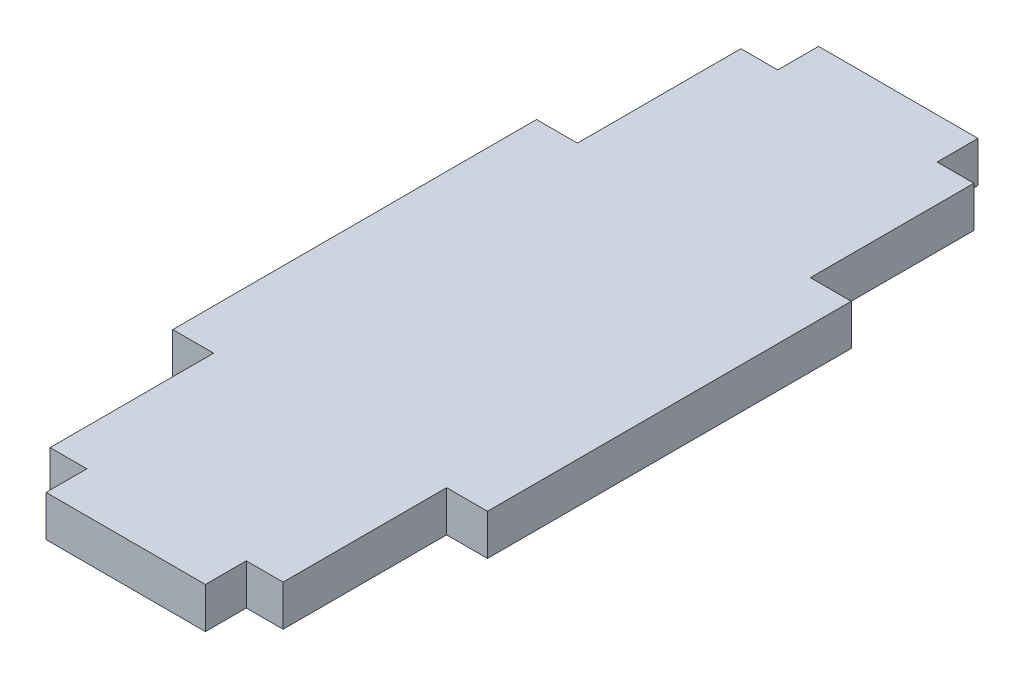
ISO-10303-21;
HEADER;
FILE_DESCRIPTION(('STEP AP214'),'2;1');
FILE_NAME('part.step','',(''),(''),'','','');
FILE_SCHEMA(('AUTOMOTIVE_DESIGN { 1 0 10303 214 1 1 1 1 }'));
ENDSEC;
DATA;
#1=APPLICATION_CONTEXT('core data for automotive mechanical design processes');
#2=APPLICATION_PROTOCOL_DEFINITION('international standard','automotive_design',2000,#1);
#3=PRODUCT_CONTEXT('',#1,'mechanical');
#4=PRODUCT('Part','Part','',(#3));
#5=PRODUCT_RELATED_PRODUCT_CATEGORY('part','',(#4));
#6=PRODUCT_DEFINITION_FORMATION('','',#4);
#7=PRODUCT_DEFINITION_CONTEXT('part definition',#1,'design');
#8=PRODUCT_DEFINITION('design','',#6,#7);
#9=PRODUCT_DEFINITION_SHAPE('','',#8);
#10=(LENGTH_UNIT() NAMED_UNIT(*) SI_UNIT(.MILLI.,.METRE.));
#11=(NAMED_UNIT(*) PLANE_ANGLE_UNIT() SI_UNIT($,.RADIAN.));
#12=(NAMED_UNIT(*) SI_UNIT($,.STERADIAN.) SOLID_ANGLE_UNIT());
#13=UNCERTAINTY_MEASURE_WITH_UNIT(LENGTH_MEASURE(1.E-05),#10,'distance_accuracy_value','');
#14=(GEOMETRIC_REPRESENTATION_CONTEXT(3) GLOBAL_UNCERTAINTY_ASSIGNED_CONTEXT((#13)) GLOBAL_UNIT_ASSIGNED_CONTEXT((#10,
#11,#12)) REPRESENTATION_CONTEXT('',''));
#15=CARTESIAN_POINT('',(0.,0.,0.));
#16=DIRECTION('',(0.,0.,1.));
#17=DIRECTION('',(1.,0.,0.));
#18=AXIS2_PLACEMENT_3D('',#15,#16,#17);
#19=CARTESIAN_POINT('',(-14.25,5.,-42.25));
#20=DIRECTION('',(1.,0.,0.));
#21=DIRECTION('',(0.,0.,-1.));
#22=AXIS2_PLACEMENT_3D('',#19,#20,#21);
#23=PLANE('',#22);
#24=DIRECTION('',(0.,0.,1.));
#25=VECTOR('',#24,1.);
#26=CARTESIAN_POINT('',(-14.25,0.,-42.25));
#27=LINE('',#26,#25);
#28=CARTESIAN_POINT('',(-14.25,0.,-42.25));
#29=VERTEX_POINT('',#28);
#30=CARTESIAN_POINT('',(-14.25,0.,-22.25));
#31=VERTEX_POINT('',#30);
#32=EDGE_CURVE('E201',#29,#31,#27,.T.);
#33=ORIENTED_EDGE('',*,*,#32,.T.);
#34=DIRECTION('',(0.,-1.,0.));
#35=VECTOR('',#34,1.);
#36=CARTESIAN_POINT('',(-14.25,5.,-22.25));
#37=LINE('',#36,#35);
#38=CARTESIAN_POINT('',(-14.25,5.,-22.25));
#39=VERTEX_POINT('',#38);
#40=EDGE_CURVE('E11',#39,#31,#37,.T.);
#41=ORIENTED_EDGE('',*,*,#40,.F.);
#42=DIRECTION('',(0.,0.,1.));
#43=VECTOR('',#42,1.);
#44=CARTESIAN_POINT('',(-14.25,5.,-42.25));
#45=LINE('',#44,#43);
#46=CARTESIAN_POINT('',(-14.25,5.,-42.25));
#47=VERTEX_POINT('',#46);
#48=EDGE_CURVE('E239',#47,#39,#45,.T.);
#49=ORIENTED_EDGE('',*,*,#48,.F.);
#50=DIRECTION('',(0.,-1.,0.));
#51=VECTOR('',#50,1.);
#52=CARTESIAN_POINT('',(-14.25,5.,-42.25));
#53=LINE('',#52,#51);
#54=EDGE_CURVE('E197',#47,#29,#53,.T.);
#55=ORIENTED_EDGE('',*,*,#54,.T.);
#56=EDGE_LOOP('',(#33,#41,#49,#55));
#57=FACE_BOUND('',#56,.T.);
#58=ADVANCED_FACE('F33',(#57),#23,.F.);
#59=CARTESIAN_POINT('',(-14.25,5.,-22.25));
#60=DIRECTION('',(0.,0.,1.));
#61=DIRECTION('',(1.,0.,0.));
#62=AXIS2_PLACEMENT_3D('',#59,#60,#61);
#63=PLANE('',#62);
#64=DIRECTION('',(-1.,0.,0.));
#65=VECTOR('',#64,1.);
#66=CARTESIAN_POINT('',(-14.25,0.,-22.25));
#67=LINE('',#66,#65);
#68=CARTESIAN_POINT('',(-19.25,0.,-22.25));
#69=VERTEX_POINT('',#68);
#70=EDGE_CURVE('E204',#31,#69,#67,.T.);
#71=ORIENTED_EDGE('',*,*,#70,.T.);
#72=DIRECTION('',(0.,-1.,0.));
#73=VECTOR('',#72,1.);
#74=CARTESIAN_POINT('',(-19.25,5.,-22.25));
#75=LINE('',#74,#73);
#76=CARTESIAN_POINT('',(-19.25,5.,-22.25));
#77=VERTEX_POINT('',#76);
#78=EDGE_CURVE('E41',#77,#69,#75,.T.);
#79=ORIENTED_EDGE('',*,*,#78,.F.);
#80=DIRECTION('',(-1.,0.,0.));
#81=VECTOR('',#80,1.);
#82=CARTESIAN_POINT('',(-14.25,5.,-22.25));
#83=LINE('',#82,#81);
#84=EDGE_CURVE('E128',#39,#77,#83,.T.);
#85=ORIENTED_EDGE('',*,*,#84,.F.);
#86=ORIENTED_EDGE('',*,*,#40,.T.);
#87=EDGE_LOOP('',(#71,#79,#85,#86));
#88=FACE_BOUND('',#87,.T.);
#89=ADVANCED_FACE('F357',(#88),#63,.F.);
#90=CARTESIAN_POINT('',(-19.25,5.,-22.25));
#91=DIRECTION('',(1.,0.,0.));
#92=DIRECTION('',(0.,0.,-1.));
#93=AXIS2_PLACEMENT_3D('',#90,#91,#92);
#94=PLANE('',#93);
#95=DIRECTION('',(0.,0.,1.));
#96=VECTOR('',#95,1.);
#97=CARTESIAN_POINT('',(-19.25,0.,-22.25));
#98=LINE('',#97,#96);
#99=CARTESIAN_POINT('',(-19.25,0.,22.25));
#100=VERTEX_POINT('',#99);
#101=EDGE_CURVE('E206',#69,#100,#98,.T.);
#102=ORIENTED_EDGE('',*,*,#101,.T.);
#103=DIRECTION('',(0.,-1.,0.));
#104=VECTOR('',#103,1.);
#105=CARTESIAN_POINT('',(-19.25,5.,22.25));
#106=LINE('',#105,#104);
#107=CARTESIAN_POINT('',(-19.25,5.,22.25));
#108=VERTEX_POINT('',#107);
#109=EDGE_CURVE('E282',#108,#100,#106,.T.);
#110=ORIENTED_EDGE('',*,*,#109,.F.);
#111=DIRECTION('',(0.,0.,1.));
#112=VECTOR('',#111,1.);
#113=CARTESIAN_POINT('',(-19.25,5.,-22.25));
#114=LINE('',#113,#112);
#115=EDGE_CURVE('E290',#77,#108,#114,.T.);
#116=ORIENTED_EDGE('',*,*,#115,.F.);
#117=ORIENTED_EDGE('',*,*,#78,.T.);
#118=EDGE_LOOP('',(#102,#110,#116,#117));
#119=FACE_BOUND('',#118,.T.);
#120=ADVANCED_FACE('F288',(#119),#94,.F.);
#121=CARTESIAN_POINT('',(-19.25,5.,22.25));
#122=DIRECTION('',(0.,0.,-1.));
#123=DIRECTION('',(-1.,0.,0.));
#124=AXIS2_PLACEMENT_3D('',#121,#122,#123);
#125=PLANE('',#124);
#126=DIRECTION('',(1.,0.,0.));
#127=VECTOR('',#126,1.);
#128=CARTESIAN_POINT('',(-19.25,0.,22.25));
#129=LINE('',#128,#127);
#130=CARTESIAN_POINT('',(-14.25,0.,22.25));
#131=VERTEX_POINT('',#130);
#132=EDGE_CURVE('E208',#100,#131,#129,.T.);
#133=ORIENTED_EDGE('',*,*,#132,.T.);
#134=DIRECTION('',(0.,-1.,0.));
#135=VECTOR('',#134,1.);
#136=CARTESIAN_POINT('',(-14.25,5.,22.25));
#137=LINE('',#136,#135);
#138=CARTESIAN_POINT('',(-14.25,5.,22.25));
#139=VERTEX_POINT('',#138);
#140=EDGE_CURVE('E279',#139,#131,#137,.T.);
#141=ORIENTED_EDGE('',*,*,#140,.F.);
#142=DIRECTION('',(1.,0.,0.));
#143=VECTOR('',#142,1.);
#144=CARTESIAN_POINT('',(-19.25,5.,22.25));
#145=LINE('',#144,#143);
#146=EDGE_CURVE('E308',#108,#139,#145,.T.);
#147=ORIENTED_EDGE('',*,*,#146,.F.);
#148=ORIENTED_EDGE('',*,*,#109,.T.);
#149=EDGE_LOOP('',(#133,#141,#147,#148));
#150=FACE_BOUND('',#149,.T.);
#151=ADVANCED_FACE('F299',(#150),#125,.F.);
#152=CARTESIAN_POINT('',(-14.25,5.,22.25));
#153=DIRECTION('',(1.,0.,0.));
#154=DIRECTION('',(0.,0.,-1.));
#155=AXIS2_PLACEMENT_3D('',#152,#153,#154);
#156=PLANE('',#155);
#157=DIRECTION('',(0.,0.,1.));
#158=VECTOR('',#157,1.);
#159=CARTESIAN_POINT('',(-14.25,0.,22.25));
#160=LINE('',#159,#158);
#161=CARTESIAN_POINT('',(-14.25,0.,42.25));
#162=VERTEX_POINT('',#161);
#163=EDGE_CURVE('E210',#131,#162,#160,.T.);
#164=ORIENTED_EDGE('',*,*,#163,.T.);
#165=DIRECTION('',(0.,-1.,0.));
#166=VECTOR('',#165,1.);
#167=CARTESIAN_POINT('',(-14.25,5.,42.25));
#168=LINE('',#167,#166);
#169=CARTESIAN_POINT('',(-14.25,5.,42.25));
#170=VERTEX_POINT('',#169);
#171=EDGE_CURVE('E276',#170,#162,#168,.T.);
#172=ORIENTED_EDGE('',*,*,#171,.F.);
#173=DIRECTION('',(0.,0.,1.));
#174=VECTOR('',#173,1.);
#175=CARTESIAN_POINT('',(-14.25,5.,22.25));
#176=LINE('',#175,#174);
#177=EDGE_CURVE('E305',#139,#170,#176,.T.);
#178=ORIENTED_EDGE('',*,*,#177,.F.);
#179=ORIENTED_EDGE('',*,*,#140,.T.);
#180=EDGE_LOOP('',(#164,#172,#178,#179));
#181=FACE_BOUND('',#180,.T.);
#182=ADVANCED_FACE('F303',(#181),#156,.F.);
#183=CARTESIAN_POINT('',(-14.25,5.,42.25));
#184=DIRECTION('',(0.,0.,-1.));
#185=DIRECTION('',(-1.,0.,0.));
#186=AXIS2_PLACEMENT_3D('',#183,#184,#185);
#187=PLANE('',#186);
#188=DIRECTION('',(1.,0.,0.));
#189=VECTOR('',#188,1.);
#190=CARTESIAN_POINT('',(-14.25,0.,42.25));
#191=LINE('',#190,#189);
#192=CARTESIAN_POINT('',(-9.75,0.,42.25));
#193=VERTEX_POINT('',#192);
#194=EDGE_CURVE('E212',#162,#193,#191,.T.);
#195=ORIENTED_EDGE('',*,*,#194,.T.);
#196=DIRECTION('',(0.,-1.,0.));
#197=VECTOR('',#196,1.);
#198=CARTESIAN_POINT('',(-9.75,5.,42.25));
#199=LINE('',#198,#197);
#200=CARTESIAN_POINT('',(-9.75,5.,42.25));
#201=VERTEX_POINT('',#200);
#202=EDGE_CURVE('E273',#201,#193,#199,.T.);
#203=ORIENTED_EDGE('',*,*,#202,.F.);
#204=DIRECTION('',(1.,0.,0.));
#205=VECTOR('',#204,1.);
#206=CARTESIAN_POINT('',(-14.25,5.,42.25));
#207=LINE('',#206,#205);
#208=EDGE_CURVE('E307',#170,#201,#207,.T.);
#209=ORIENTED_EDGE('',*,*,#208,.F.);
#210=ORIENTED_EDGE('',*,*,#171,.T.);
#211=EDGE_LOOP('',(#195,#203,#209,#210));
#212=FACE_BOUND('',#211,.T.);
#213=ADVANCED_FACE('F370',(#212),#187,.F.);
#214=CARTESIAN_POINT('',(-9.75,5.,42.25));
#215=DIRECTION('',(1.,0.,0.));
#216=DIRECTION('',(0.,0.,-1.));
#217=AXIS2_PLACEMENT_3D('',#214,#215,#216);
#218=PLANE('',#217);
#219=DIRECTION('',(0.,0.,1.));
#220=VECTOR('',#219,1.);
#221=CARTESIAN_POINT('',(-9.75,0.,42.25));
#222=LINE('',#221,#220);
#223=CARTESIAN_POINT('',(-9.74999999999997,0.,47.25));
#224=VERTEX_POINT('',#223);
#225=EDGE_CURVE('E214',#193,#224,#222,.T.);
#226=ORIENTED_EDGE('',*,*,#225,.T.);
#227=DIRECTION('',(0.,-1.,0.));
#228=VECTOR('',#227,1.);
#229=CARTESIAN_POINT('',(-9.74999999999997,5.,47.25));
#230=LINE('',#229,#228);
#231=CARTESIAN_POINT('',(-9.74999999999997,5.,47.25));
#232=VERTEX_POINT('',#231);
#233=EDGE_CURVE('E270',#232,#224,#230,.T.);
#234=ORIENTED_EDGE('',*,*,#233,.F.);
#235=DIRECTION('',(0.,0.,1.));
#236=VECTOR('',#235,1.);
#237=CARTESIAN_POINT('',(-9.75,5.,42.25));
#238=LINE('',#237,#236);
#239=EDGE_CURVE('E310',#201,#232,#238,.T.);
#240=ORIENTED_EDGE('',*,*,#239,.F.);
#241=ORIENTED_EDGE('',*,*,#202,.T.);
#242=EDGE_LOOP('',(#226,#234,#240,#241));
#243=FACE_BOUND('',#242,.T.);
#244=ADVANCED_FACE('F373',(#243),#218,.F.);
#245=CARTESIAN_POINT('',(-9.74999999999997,5.,47.25));
#246=DIRECTION('',(0.,0.,-1.));
#247=DIRECTION('',(-1.,0.,0.));
#248=AXIS2_PLACEMENT_3D('',#245,#246,#247);
#249=PLANE('',#248);
#250=DIRECTION('',(1.,0.,0.));
#251=VECTOR('',#250,1.);
#252=CARTESIAN_POINT('',(-9.74999999999997,0.,47.25));
#253=LINE('',#252,#251);
#254=CARTESIAN_POINT('',(9.75000000000001,0.,47.25));
#255=VERTEX_POINT('',#254);
#256=EDGE_CURVE('E216',#224,#255,#253,.T.);
#257=ORIENTED_EDGE('',*,*,#256,.T.);
#258=DIRECTION('',(0.,-1.,0.));
#259=VECTOR('',#258,1.);
#260=CARTESIAN_POINT('',(9.75000000000001,5.,47.25));
#261=LINE('',#260,#259);
#262=CARTESIAN_POINT('',(9.75000000000001,5.,47.25));
#263=VERTEX_POINT('',#262);
#264=EDGE_CURVE('E267',#263,#255,#261,.T.);
#265=ORIENTED_EDGE('',*,*,#264,.F.);
#266=DIRECTION('',(1.,0.,0.));
#267=VECTOR('',#266,1.);
#268=CARTESIAN_POINT('',(-9.74999999999997,5.,47.25));
#269=LINE('',#268,#267);
#270=EDGE_CURVE('E316',#232,#263,#269,.T.);
#271=ORIENTED_EDGE('',*,*,#270,.F.);
#272=ORIENTED_EDGE('',*,*,#233,.T.);
#273=EDGE_LOOP('',(#257,#265,#271,#272));
#274=FACE_BOUND('',#273,.T.);
#275=ADVANCED_FACE('F377',(#274),#249,.F.);
#276=CARTESIAN_POINT('',(9.75000000000001,5.,47.25));
#277=DIRECTION('',(-1.,0.,0.));
#278=DIRECTION('',(0.,0.,1.));
#279=AXIS2_PLACEMENT_3D('',#276,#277,#278);
#280=PLANE('',#279);
#281=DIRECTION('',(0.,0.,-1.));
#282=VECTOR('',#281,1.);
#283=CARTESIAN_POINT('',(9.75000000000001,0.,47.25));
#284=LINE('',#283,#282);
#285=CARTESIAN_POINT('',(9.75000000000002,0.,42.25));
#286=VERTEX_POINT('',#285);
#287=EDGE_CURVE('E218',#255,#286,#284,.T.);
#288=ORIENTED_EDGE('',*,*,#287,.T.);
#289=DIRECTION('',(0.,-1.,0.));
#290=VECTOR('',#289,1.);
#291=CARTESIAN_POINT('',(9.75000000000002,5.,42.25));
#292=LINE('',#291,#290);
#293=CARTESIAN_POINT('',(9.75000000000002,5.,42.25));
#294=VERTEX_POINT('',#293);
#295=EDGE_CURVE('E264',#294,#286,#292,.T.);
#296=ORIENTED_EDGE('',*,*,#295,.F.);
#297=DIRECTION('',(0.,0.,-1.));
#298=VECTOR('',#297,1.);
#299=CARTESIAN_POINT('',(9.75000000000001,5.,47.25));
#300=LINE('',#299,#298);
#301=EDGE_CURVE('E318',#263,#294,#300,.T.);
#302=ORIENTED_EDGE('',*,*,#301,.F.);
#303=ORIENTED_EDGE('',*,*,#264,.T.);
#304=EDGE_LOOP('',(#288,#296,#302,#303));
#305=FACE_BOUND('',#304,.T.);
#306=ADVANCED_FACE('F381',(#305),#280,.F.);
#307=CARTESIAN_POINT('',(9.75000000000002,5.,42.25));
#308=DIRECTION('',(0.,0.,-1.));
#309=DIRECTION('',(-1.,0.,0.));
#310=AXIS2_PLACEMENT_3D('',#307,#308,#309);
#311=PLANE('',#310);
#312=DIRECTION('',(1.,0.,0.));
#313=VECTOR('',#312,1.);
#314=CARTESIAN_POINT('',(9.75000000000002,0.,42.25));
#315=LINE('',#314,#313);
#316=CARTESIAN_POINT('',(14.25,0.,42.25));
#317=VERTEX_POINT('',#316);
#318=EDGE_CURVE('E220',#286,#317,#315,.T.);
#319=ORIENTED_EDGE('',*,*,#318,.T.);
#320=DIRECTION('',(0.,-1.,0.));
#321=VECTOR('',#320,1.);
#322=CARTESIAN_POINT('',(14.25,5.,42.25));
#323=LINE('',#322,#321);
#324=CARTESIAN_POINT('',(14.25,5.,42.25));
#325=VERTEX_POINT('',#324);
#326=EDGE_CURVE('E261',#325,#317,#323,.T.);
#327=ORIENTED_EDGE('',*,*,#326,.F.);
#328=DIRECTION('',(1.,0.,0.));
#329=VECTOR('',#328,1.);
#330=CARTESIAN_POINT('',(9.75000000000002,5.,42.25));
#331=LINE('',#330,#329);
#332=EDGE_CURVE('E320',#294,#325,#331,.T.);
#333=ORIENTED_EDGE('',*,*,#332,.F.);
#334=ORIENTED_EDGE('',*,*,#295,.T.);
#335=EDGE_LOOP('',(#319,#327,#333,#334));
#336=FACE_BOUND('',#335,.T.);
#337=ADVANCED_FACE('F385',(#336),#311,.F.);
#338=CARTESIAN_POINT('',(14.25,5.,22.25));
#339=DIRECTION('',(-1.,0.,0.));
#340=DIRECTION('',(0.,0.,1.));
#341=AXIS2_PLACEMENT_3D('',#338,#339,#340);
#342=PLANE('',#341);
#343=DIRECTION('',(0.,0.,-1.));
#344=VECTOR('',#343,1.);
#345=CARTESIAN_POINT('',(14.25,0.,22.25));
#346=LINE('',#345,#344);
#347=CARTESIAN_POINT('',(14.25,0.,22.25));
#348=VERTEX_POINT('',#347);
#349=EDGE_CURVE('E222',#317,#348,#346,.T.);
#350=ORIENTED_EDGE('',*,*,#349,.T.);
#351=DIRECTION('',(0.,-1.,0.));
#352=VECTOR('',#351,1.);
#353=CARTESIAN_POINT('',(14.25,5.,22.25));
#354=LINE('',#353,#352);
#355=CARTESIAN_POINT('',(14.25,5.,22.25));
#356=VERTEX_POINT('',#355);
#357=EDGE_CURVE('E258',#356,#348,#354,.T.);
#358=ORIENTED_EDGE('',*,*,#357,.F.);
#359=DIRECTION('',(0.,0.,-1.));
#360=VECTOR('',#359,1.);
#361=CARTESIAN_POINT('',(14.25,5.,22.25));
#362=LINE('',#361,#360);
#363=EDGE_CURVE('E322',#325,#356,#362,.T.);
#364=ORIENTED_EDGE('',*,*,#363,.F.);
#365=ORIENTED_EDGE('',*,*,#326,.T.);
#366=EDGE_LOOP('',(#350,#358,#364,#365));
#367=FACE_BOUND('',#366,.T.);
#368=ADVANCED_FACE('F389',(#367),#342,.F.);
#369=CARTESIAN_POINT('',(19.25,5.,22.25));
#370=DIRECTION('',(0.,0.,-1.));
#371=DIRECTION('',(-1.,0.,0.));
#372=AXIS2_PLACEMENT_3D('',#369,#370,#371);
#373=PLANE('',#372);
#374=DIRECTION('',(1.,0.,0.));
#375=VECTOR('',#374,1.);
#376=CARTESIAN_POINT('',(19.25,0.,22.25));
#377=LINE('',#376,#375);
#378=CARTESIAN_POINT('',(19.25,0.,22.25));
#379=VERTEX_POINT('',#378);
#380=EDGE_CURVE('E224',#348,#379,#377,.T.);
#381=ORIENTED_EDGE('',*,*,#380,.T.);
#382=DIRECTION('',(0.,-1.,0.));
#383=VECTOR('',#382,1.);
#384=CARTESIAN_POINT('',(19.25,5.,22.25));
#385=LINE('',#384,#383);
#386=CARTESIAN_POINT('',(19.25,5.,22.25));
#387=VERTEX_POINT('',#386);
#388=EDGE_CURVE('E255',#387,#379,#385,.T.);
#389=ORIENTED_EDGE('',*,*,#388,.F.);
#390=DIRECTION('',(1.,0.,0.));
#391=VECTOR('',#390,1.);
#392=CARTESIAN_POINT('',(19.25,5.,22.25));
#393=LINE('',#392,#391);
#394=EDGE_CURVE('E324',#356,#387,#393,.T.);
#395=ORIENTED_EDGE('',*,*,#394,.F.);
#396=ORIENTED_EDGE('',*,*,#357,.T.);
#397=EDGE_LOOP('',(#381,#389,#395,#396));
#398=FACE_BOUND('',#397,.T.);
#399=ADVANCED_FACE('F393',(#398),#373,.F.);
#400=CARTESIAN_POINT('',(19.25,5.,-22.25));
#401=DIRECTION('',(-1.,0.,0.));
#402=DIRECTION('',(0.,0.,1.));
#403=AXIS2_PLACEMENT_3D('',#400,#401,#402);
#404=PLANE('',#403);
#405=DIRECTION('',(0.,0.,-1.));
#406=VECTOR('',#405,1.);
#407=CARTESIAN_POINT('',(19.25,0.,-22.25));
#408=LINE('',#407,#406);
#409=CARTESIAN_POINT('',(19.25,0.,-22.25));
#410=VERTEX_POINT('',#409);
#411=EDGE_CURVE('E226',#379,#410,#408,.T.);
#412=ORIENTED_EDGE('',*,*,#411,.T.);
#413=DIRECTION('',(0.,-1.,0.));
#414=VECTOR('',#413,1.);
#415=CARTESIAN_POINT('',(19.25,5.,-22.25));
#416=LINE('',#415,#414);
#417=CARTESIAN_POINT('',(19.25,5.,-22.25));
#418=VERTEX_POINT('',#417);
#419=EDGE_CURVE('E252',#418,#410,#416,.T.);
#420=ORIENTED_EDGE('',*,*,#419,.F.);
#421=DIRECTION('',(0.,0.,-1.));
#422=VECTOR('',#421,1.);
#423=CARTESIAN_POINT('',(19.25,5.,-22.25));
#424=LINE('',#423,#422);
#425=EDGE_CURVE('E326',#387,#418,#424,.T.);
#426=ORIENTED_EDGE('',*,*,#425,.F.);
#427=ORIENTED_EDGE('',*,*,#388,.T.);
#428=EDGE_LOOP('',(#412,#420,#426,#427));
#429=FACE_BOUND('',#428,.T.);
#430=ADVANCED_FACE('F397',(#429),#404,.F.);
#431=CARTESIAN_POINT('',(14.25,5.,-22.25));
#432=DIRECTION('',(0.,0.,1.));
#433=DIRECTION('',(1.,0.,0.));
#434=AXIS2_PLACEMENT_3D('',#431,#432,#433);
#435=PLANE('',#434);
#436=DIRECTION('',(-1.,0.,0.));
#437=VECTOR('',#436,1.);
#438=CARTESIAN_POINT('',(14.25,0.,-22.25));
#439=LINE('',#438,#437);
#440=CARTESIAN_POINT('',(14.25,0.,-22.25));
#441=VERTEX_POINT('',#440);
#442=EDGE_CURVE('E228',#410,#441,#439,.T.);
#443=ORIENTED_EDGE('',*,*,#442,.T.);
#444=DIRECTION('',(0.,-1.,0.));
#445=VECTOR('',#444,1.);
#446=CARTESIAN_POINT('',(14.25,5.,-22.25));
#447=LINE('',#446,#445);
#448=CARTESIAN_POINT('',(14.25,5.,-22.25));
#449=VERTEX_POINT('',#448);
#450=EDGE_CURVE('E249',#449,#441,#447,.T.);
#451=ORIENTED_EDGE('',*,*,#450,.F.);
#452=DIRECTION('',(-1.,0.,0.));
#453=VECTOR('',#452,1.);
#454=CARTESIAN_POINT('',(14.25,5.,-22.25));
#455=LINE('',#454,#453);
#456=EDGE_CURVE('E328',#418,#449,#455,.T.);
#457=ORIENTED_EDGE('',*,*,#456,.F.);
#458=ORIENTED_EDGE('',*,*,#419,.T.);
#459=EDGE_LOOP('',(#443,#451,#457,#458));
#460=FACE_BOUND('',#459,.T.);
#461=ADVANCED_FACE('F401',(#460),#435,.F.);
#462=CARTESIAN_POINT('',(14.25,5.,-42.25));
#463=DIRECTION('',(-1.,0.,0.));
#464=DIRECTION('',(0.,0.,1.));
#465=AXIS2_PLACEMENT_3D('',#462,#463,#464);
#466=PLANE('',#465);
#467=DIRECTION('',(0.,0.,-1.));
#468=VECTOR('',#467,1.);
#469=CARTESIAN_POINT('',(14.25,0.,-42.25));
#470=LINE('',#469,#468);
#471=CARTESIAN_POINT('',(14.25,0.,-42.25));
#472=VERTEX_POINT('',#471);
#473=EDGE_CURVE('E230',#441,#472,#470,.T.);
#474=ORIENTED_EDGE('',*,*,#473,.T.);
#475=DIRECTION('',(0.,-1.,0.));
#476=VECTOR('',#475,1.);
#477=CARTESIAN_POINT('',(14.25,5.,-42.25));
#478=LINE('',#477,#476);
#479=CARTESIAN_POINT('',(14.25,5.,-42.25));
#480=VERTEX_POINT('',#479);
#481=EDGE_CURVE('E246',#480,#472,#478,.T.);
#482=ORIENTED_EDGE('',*,*,#481,.F.);
#483=DIRECTION('',(0.,0.,-1.));
#484=VECTOR('',#483,1.);
#485=CARTESIAN_POINT('',(14.25,5.,-42.25));
#486=LINE('',#485,#484);
#487=EDGE_CURVE('E330',#449,#480,#486,.T.);
#488=ORIENTED_EDGE('',*,*,#487,.F.);
#489=ORIENTED_EDGE('',*,*,#450,.T.);
#490=EDGE_LOOP('',(#474,#482,#488,#489));
#491=FACE_BOUND('',#490,.T.);
#492=ADVANCED_FACE('F405',(#491),#466,.F.);
#493=CARTESIAN_POINT('',(9.75,5.,-42.25));
#494=DIRECTION('',(0.,0.,1.));
#495=DIRECTION('',(1.,0.,0.));
#496=AXIS2_PLACEMENT_3D('',#493,#494,#495);
#497=PLANE('',#496);
#498=DIRECTION('',(-1.,0.,0.));
#499=VECTOR('',#498,1.);
#500=CARTESIAN_POINT('',(9.75,0.,-42.25));
#501=LINE('',#500,#499);
#502=CARTESIAN_POINT('',(9.75,0.,-42.25));
#503=VERTEX_POINT('',#502);
#504=EDGE_CURVE('E232',#472,#503,#501,.T.);
#505=ORIENTED_EDGE('',*,*,#504,.T.);
#506=DIRECTION('',(0.,-1.,0.));
#507=VECTOR('',#506,1.);
#508=CARTESIAN_POINT('',(9.75,5.,-42.25));
#509=LINE('',#508,#507);
#510=CARTESIAN_POINT('',(9.75,5.,-42.25));
#511=VERTEX_POINT('',#510);
#512=EDGE_CURVE('E243',#511,#503,#509,.T.);
#513=ORIENTED_EDGE('',*,*,#512,.F.);
#514=DIRECTION('',(-1.,0.,0.));
#515=VECTOR('',#514,1.);
#516=CARTESIAN_POINT('',(9.75,5.,-42.25));
#517=LINE('',#516,#515);
#518=EDGE_CURVE('E332',#480,#511,#517,.T.);
#519=ORIENTED_EDGE('',*,*,#518,.F.);
#520=ORIENTED_EDGE('',*,*,#481,.T.);
#521=EDGE_LOOP('',(#505,#513,#519,#520));
#522=FACE_BOUND('',#521,.T.);
#523=ADVANCED_FACE('F338',(#522),#497,.F.);
#524=CARTESIAN_POINT('',(9.75000000000001,5.,-47.25));
#525=DIRECTION('',(-1.,0.,0.));
#526=DIRECTION('',(0.,0.,1.));
#527=AXIS2_PLACEMENT_3D('',#524,#525,#526);
#528=PLANE('',#527);
#529=DIRECTION('',(0.,0.,-1.));
#530=VECTOR('',#529,1.);
#531=CARTESIAN_POINT('',(9.75000000000001,0.,-47.25));
#532=LINE('',#531,#530);
#533=CARTESIAN_POINT('',(9.75000000000001,0.,-47.25));
#534=VERTEX_POINT('',#533);
#535=EDGE_CURVE('E234',#503,#534,#532,.T.);
#536=ORIENTED_EDGE('',*,*,#535,.T.);
#537=DIRECTION('',(0.,-1.,0.));
#538=VECTOR('',#537,1.);
#539=CARTESIAN_POINT('',(9.75000000000001,5.,-47.25));
#540=LINE('',#539,#538);
#541=CARTESIAN_POINT('',(9.75000000000001,5.,-47.25));
#542=VERTEX_POINT('',#541);
#543=EDGE_CURVE('E192',#542,#534,#540,.T.);
#544=ORIENTED_EDGE('',*,*,#543,.F.);
#545=DIRECTION('',(0.,0.,-1.));
#546=VECTOR('',#545,1.);
#547=CARTESIAN_POINT('',(9.75000000000001,5.,-47.25));
#548=LINE('',#547,#546);
#549=EDGE_CURVE('E183',#511,#542,#548,.T.);
#550=ORIENTED_EDGE('',*,*,#549,.F.);
#551=ORIENTED_EDGE('',*,*,#512,.T.);
#552=EDGE_LOOP('',(#536,#544,#550,#551));
#553=FACE_BOUND('',#552,.T.);
#554=ADVANCED_FACE('F342',(#553),#528,.F.);
#555=CARTESIAN_POINT('',(-9.75,5.,-47.25));
#556=DIRECTION('',(0.,0.,1.));
#557=DIRECTION('',(1.,0.,0.));
#558=AXIS2_PLACEMENT_3D('',#555,#556,#557);
#559=PLANE('',#558);
#560=DIRECTION('',(-1.,0.,0.));
#561=VECTOR('',#560,1.);
#562=CARTESIAN_POINT('',(-9.75,0.,-47.25));
#563=LINE('',#562,#561);
#564=CARTESIAN_POINT('',(-9.75,0.,-47.25));
#565=VERTEX_POINT('',#564);
#566=EDGE_CURVE('E191',#534,#565,#563,.T.);
#567=ORIENTED_EDGE('',*,*,#566,.T.);
#568=DIRECTION('',(0.,-1.,0.));
#569=VECTOR('',#568,1.);
#570=CARTESIAN_POINT('',(-9.75,5.,-47.25));
#571=LINE('',#570,#569);
#572=CARTESIAN_POINT('',(-9.75,5.,-47.25));
#573=VERTEX_POINT('',#572);
#574=EDGE_CURVE('E188',#573,#565,#571,.T.);
#575=ORIENTED_EDGE('',*,*,#574,.F.);
#576=DIRECTION('',(-1.,0.,0.));
#577=VECTOR('',#576,1.);
#578=CARTESIAN_POINT('',(-9.75,5.,-47.25));
#579=LINE('',#578,#577);
#580=EDGE_CURVE('E177',#542,#573,#579,.T.);
#581=ORIENTED_EDGE('',*,*,#580,.F.);
#582=ORIENTED_EDGE('',*,*,#543,.T.);
#583=EDGE_LOOP('',(#567,#575,#581,#582));
#584=FACE_BOUND('',#583,.T.);
#585=ADVANCED_FACE('F189',(#584),#559,.F.);
#586=CARTESIAN_POINT('',(-9.75,5.,-42.25));
#587=DIRECTION('',(1.,0.,0.));
#588=DIRECTION('',(0.,0.,-1.));
#589=AXIS2_PLACEMENT_3D('',#586,#587,#588);
#590=PLANE('',#589);
#591=DIRECTION('',(0.,0.,1.));
#592=VECTOR('',#591,1.);
#593=CARTESIAN_POINT('',(-9.75,0.,-42.25));
#594=LINE('',#593,#592);
#595=CARTESIAN_POINT('',(-9.75,0.,-42.25));
#596=VERTEX_POINT('',#595);
#597=EDGE_CURVE('E114',#565,#596,#594,.T.);
#598=ORIENTED_EDGE('',*,*,#597,.T.);
#599=DIRECTION('',(0.,-1.,0.));
#600=VECTOR('',#599,1.);
#601=CARTESIAN_POINT('',(-9.75,5.,-42.25));
#602=LINE('',#601,#600);
#603=CARTESIAN_POINT('',(-9.75,5.,-42.25));
#604=VERTEX_POINT('',#603);
#605=EDGE_CURVE('E193',#604,#596,#602,.T.);
#606=ORIENTED_EDGE('',*,*,#605,.F.);
#607=DIRECTION('',(0.,0.,1.));
#608=VECTOR('',#607,1.);
#609=CARTESIAN_POINT('',(-9.75,5.,-42.25));
#610=LINE('',#609,#608);
#611=EDGE_CURVE('E181',#573,#604,#610,.T.);
#612=ORIENTED_EDGE('',*,*,#611,.F.);
#613=ORIENTED_EDGE('',*,*,#574,.T.);
#614=EDGE_LOOP('',(#598,#606,#612,#613));
#615=FACE_BOUND('',#614,.T.);
#616=ADVANCED_FACE('F195',(#615),#590,.F.);
#617=CARTESIAN_POINT('',(-14.25,5.,-42.25));
#618=DIRECTION('',(0.,0.,1.));
#619=DIRECTION('',(1.,0.,0.));
#620=AXIS2_PLACEMENT_3D('',#617,#618,#619);
#621=PLANE('',#620);
#622=DIRECTION('',(-1.,0.,0.));
#623=VECTOR('',#622,1.);
#624=CARTESIAN_POINT('',(-14.25,0.,-42.25));
#625=LINE('',#624,#623);
#626=EDGE_CURVE('E120',#596,#29,#625,.T.);
#627=ORIENTED_EDGE('',*,*,#626,.T.);
#628=ORIENTED_EDGE('',*,*,#54,.F.);
#629=DIRECTION('',(-1.,0.,0.));
#630=VECTOR('',#629,1.);
#631=CARTESIAN_POINT('',(-14.25,5.,-42.25));
#632=LINE('',#631,#630);
#633=EDGE_CURVE('E49',#604,#47,#632,.T.);
#634=ORIENTED_EDGE('',*,*,#633,.F.);
#635=ORIENTED_EDGE('',*,*,#605,.T.);
#636=EDGE_LOOP('',(#627,#628,#634,#635));
#637=FACE_BOUND('',#636,.T.);
#638=ADVANCED_FACE('F346',(#637),#621,.F.);
#639=CARTESIAN_POINT('',(0.,5.,0.));
#640=DIRECTION('',(0.,-1.,0.));
#641=DIRECTION('',(0.,0.,-1.));
#642=AXIS2_PLACEMENT_3D('',#639,#640,#641);
#643=PLANE('',#642);
#644=ORIENTED_EDGE('',*,*,#48,.T.);
#645=ORIENTED_EDGE('',*,*,#84,.T.);
#646=ORIENTED_EDGE('',*,*,#115,.T.);
#647=ORIENTED_EDGE('',*,*,#146,.T.);
#648=ORIENTED_EDGE('',*,*,#177,.T.);
#649=ORIENTED_EDGE('',*,*,#208,.T.);
#650=ORIENTED_EDGE('',*,*,#239,.T.);
#651=ORIENTED_EDGE('',*,*,#270,.T.);
#652=ORIENTED_EDGE('',*,*,#301,.T.);
#653=ORIENTED_EDGE('',*,*,#332,.T.);
#654=ORIENTED_EDGE('',*,*,#363,.T.);
#655=ORIENTED_EDGE('',*,*,#394,.T.);
#656=ORIENTED_EDGE('',*,*,#425,.T.);
#657=ORIENTED_EDGE('',*,*,#456,.T.);
#658=ORIENTED_EDGE('',*,*,#487,.T.);
#659=ORIENTED_EDGE('',*,*,#518,.T.);
#660=ORIENTED_EDGE('',*,*,#549,.T.);
#661=ORIENTED_EDGE('',*,*,#580,.T.);
#662=ORIENTED_EDGE('',*,*,#611,.T.);
#663=ORIENTED_EDGE('',*,*,#633,.T.);
#664=EDGE_LOOP('',(#644,#645,#646,#647,#648,#649,#650,#651,#652,#653,#654,#655,#656,#657,#658,
#659,#660,#661,#662,#663));
#665=FACE_BOUND('',#664,.T.);
#666=ADVANCED_FACE('F179',(#665),#643,.F.);
#667=CARTESIAN_POINT('',(0.,0.,0.));
#668=DIRECTION('',(0.,-1.,0.));
#669=DIRECTION('',(0.,0.,-1.));
#670=AXIS2_PLACEMENT_3D('',#667,#668,#669);
#671=PLANE('',#670);
#672=ORIENTED_EDGE('',*,*,#32,.F.);
#673=ORIENTED_EDGE('',*,*,#626,.F.);
#674=ORIENTED_EDGE('',*,*,#597,.F.);
#675=ORIENTED_EDGE('',*,*,#566,.F.);
#676=ORIENTED_EDGE('',*,*,#535,.F.);
#677=ORIENTED_EDGE('',*,*,#504,.F.);
#678=ORIENTED_EDGE('',*,*,#473,.F.);
#679=ORIENTED_EDGE('',*,*,#442,.F.);
#680=ORIENTED_EDGE('',*,*,#411,.F.);
#681=ORIENTED_EDGE('',*,*,#380,.F.);
#682=ORIENTED_EDGE('',*,*,#349,.F.);
#683=ORIENTED_EDGE('',*,*,#318,.F.);
#684=ORIENTED_EDGE('',*,*,#287,.F.);
#685=ORIENTED_EDGE('',*,*,#256,.F.);
#686=ORIENTED_EDGE('',*,*,#225,.F.);
#687=ORIENTED_EDGE('',*,*,#194,.F.);
#688=ORIENTED_EDGE('',*,*,#163,.F.);
#689=ORIENTED_EDGE('',*,*,#132,.F.);
#690=ORIENTED_EDGE('',*,*,#101,.F.);
#691=ORIENTED_EDGE('',*,*,#70,.F.);
#692=EDGE_LOOP('',(#672,#673,#674,#675,#676,#677,#678,#679,#680,#681,#682,#683,#684,#685,#686,
#687,#688,#689,#690,#691));
#693=FACE_BOUND('',#692,.T.);
#694=ADVANCED_FACE('F294',(#693),#671,.T.);
#695=CLOSED_SHELL('',(#58,#89,#120,#151,#182,#213,#244,#275,#306,#337,#368,#399,#430,#461,#492,
#523,#554,#585,#616,#638,#666,#694));
#696=MANIFOLD_SOLID_BREP('B2',#695);
#697=ADVANCED_BREP_SHAPE_REPRESENTATION('',(#18,#696),#14);
#698=SHAPE_DEFINITION_REPRESENTATION(#9,#697);
ENDSEC;
END-ISO-10303-21;
